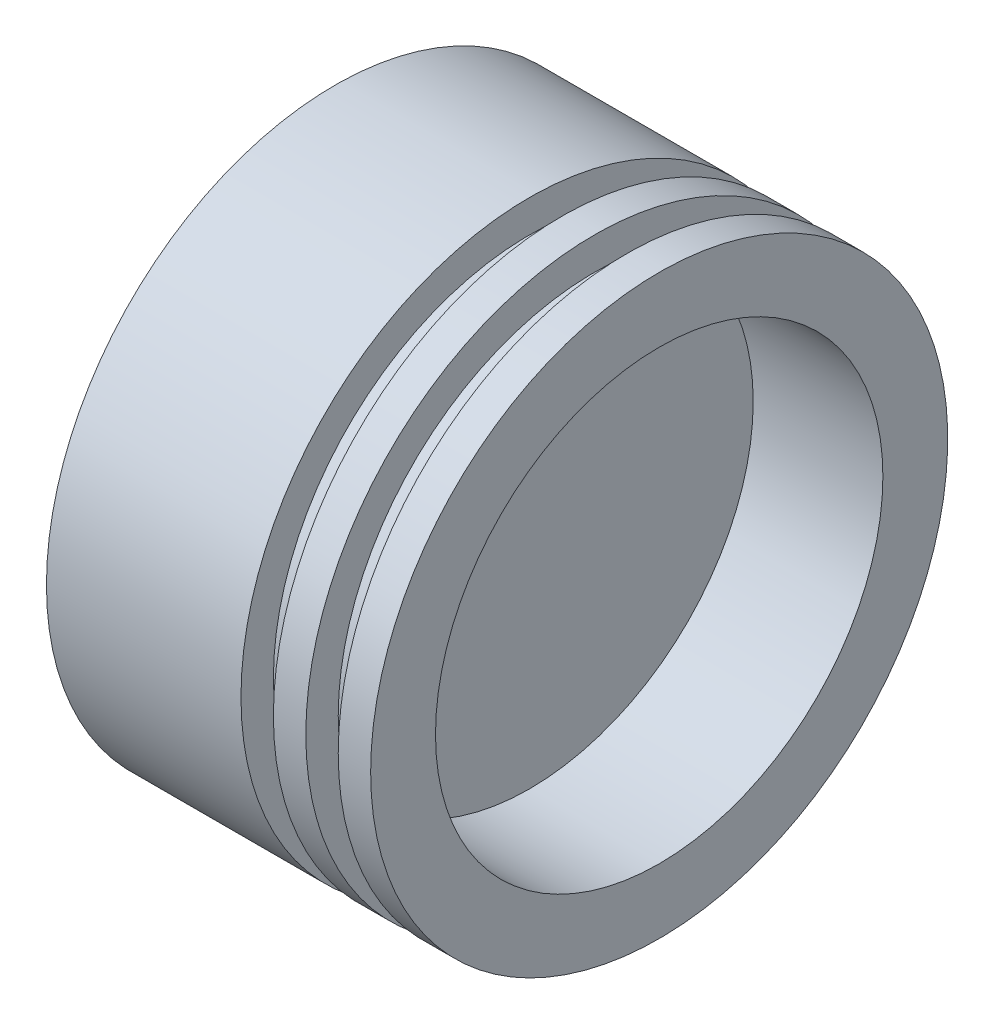
ISO-10303-21;
HEADER;
FILE_DESCRIPTION(('STEP AP214'),'2;1');
FILE_NAME('part.step','',(''),(''),'','','');
FILE_SCHEMA(('AUTOMOTIVE_DESIGN { 1 0 10303 214 1 1 1 1 }'));
ENDSEC;
DATA;
#1=APPLICATION_CONTEXT('core data for automotive mechanical design processes');
#2=APPLICATION_PROTOCOL_DEFINITION('international standard','automotive_design',2000,#1);
#3=PRODUCT_CONTEXT('',#1,'mechanical');
#4=PRODUCT('Part','Part','',(#3));
#5=PRODUCT_RELATED_PRODUCT_CATEGORY('part','',(#4));
#6=PRODUCT_DEFINITION_FORMATION('','',#4);
#7=PRODUCT_DEFINITION_CONTEXT('part definition',#1,'design');
#8=PRODUCT_DEFINITION('design','',#6,#7);
#9=PRODUCT_DEFINITION_SHAPE('','',#8);
#10=(LENGTH_UNIT() NAMED_UNIT(*) SI_UNIT(.MILLI.,.METRE.));
#11=(NAMED_UNIT(*) PLANE_ANGLE_UNIT() SI_UNIT($,.RADIAN.));
#12=(NAMED_UNIT(*) SI_UNIT($,.STERADIAN.) SOLID_ANGLE_UNIT());
#13=UNCERTAINTY_MEASURE_WITH_UNIT(LENGTH_MEASURE(1.E-05),#10,'distance_accuracy_value','');
#14=(GEOMETRIC_REPRESENTATION_CONTEXT(3) GLOBAL_UNCERTAINTY_ASSIGNED_CONTEXT((#13)) GLOBAL_UNIT_ASSIGNED_CONTEXT((#10,
#11,#12)) REPRESENTATION_CONTEXT('',''));
#15=CARTESIAN_POINT('',(0.,0.,0.));
#16=DIRECTION('',(0.,0.,1.));
#17=DIRECTION('',(1.,0.,0.));
#18=AXIS2_PLACEMENT_3D('',#15,#16,#17);
#19=CARTESIAN_POINT('',(0.,0.,0.));
#20=DIRECTION('',(1.,0.,0.));
#21=DIRECTION('',(0.,0.,-1.));
#22=AXIS2_PLACEMENT_3D('',#19,#20,#21);
#23=PLANE('',#22);
#24=CARTESIAN_POINT('',(0.,0.,0.));
#25=DIRECTION('',(-1.,0.,0.));
#26=DIRECTION('',(0.,0.,1.));
#27=AXIS2_PLACEMENT_3D('',#24,#25,#26);
#28=CIRCLE('',#27,44.5);
#29=CARTESIAN_POINT('',(0.,0.,44.5));
#30=VERTEX_POINT('',#29);
#31=EDGE_CURVE('E10',#30,#30,#28,.T.);
#32=ORIENTED_EDGE('',*,*,#31,.T.);
#33=EDGE_LOOP('',(#32));
#34=FACE_BOUND('',#33,.T.);
#35=ADVANCED_FACE('F35',(#34),#23,.F.);
#36=CARTESIAN_POINT('',(0.,0.,0.));
#37=DIRECTION('',(-1.,0.,0.));
#38=DIRECTION('',(0.,0.,1.));
#39=AXIS2_PLACEMENT_3D('',#36,#37,#38);
#40=CYLINDRICAL_SURFACE('',#39,44.5);
#41=ORIENTED_EDGE('',*,*,#31,.F.);
#42=EDGE_LOOP('',(#41));
#43=FACE_BOUND('',#42,.T.);
#44=CARTESIAN_POINT('',(30.,0.,0.));
#45=DIRECTION('',(-1.,0.,0.));
#46=DIRECTION('',(0.,0.,1.));
#47=AXIS2_PLACEMENT_3D('',#44,#45,#46);
#48=CIRCLE('',#47,44.5);
#49=CARTESIAN_POINT('',(30.,0.,44.5));
#50=VERTEX_POINT('',#49);
#51=EDGE_CURVE('E41',#50,#50,#48,.T.);
#52=ORIENTED_EDGE('',*,*,#51,.T.);
#53=EDGE_LOOP('',(#52));
#54=FACE_BOUND('',#53,.T.);
#55=ADVANCED_FACE('F91',(#43,#54),#40,.T.);
#56=CARTESIAN_POINT('',(30.,44.5,0.));
#57=DIRECTION('',(-1.,0.,0.));
#58=DIRECTION('',(0.,0.,1.));
#59=AXIS2_PLACEMENT_3D('',#56,#57,#58);
#60=PLANE('',#59);
#61=ORIENTED_EDGE('',*,*,#51,.F.);
#62=EDGE_LOOP('',(#61));
#63=FACE_BOUND('',#62,.T.);
#64=CARTESIAN_POINT('',(30.,0.,0.));
#65=DIRECTION('',(-1.,0.,0.));
#66=DIRECTION('',(0.,0.,1.));
#67=AXIS2_PLACEMENT_3D('',#64,#65,#66);
#68=CIRCLE('',#67,39.5);
#69=CARTESIAN_POINT('',(30.,0.,39.5));
#70=VERTEX_POINT('',#69);
#71=EDGE_CURVE('E45',#70,#70,#68,.T.);
#72=ORIENTED_EDGE('',*,*,#71,.T.);
#73=EDGE_LOOP('',(#72));
#74=FACE_BOUND('',#73,.T.);
#75=ADVANCED_FACE('F95',(#63,#74),#60,.F.);
#76=CARTESIAN_POINT('',(0.,0.,0.));
#77=DIRECTION('',(-1.,0.,0.));
#78=DIRECTION('',(0.,0.,1.));
#79=AXIS2_PLACEMENT_3D('',#76,#77,#78);
#80=CYLINDRICAL_SURFACE('',#79,39.5);
#81=ORIENTED_EDGE('',*,*,#71,.F.);
#82=EDGE_LOOP('',(#81));
#83=FACE_BOUND('',#82,.T.);
#84=CARTESIAN_POINT('',(35.,0.,0.));
#85=DIRECTION('',(-1.,0.,0.));
#86=DIRECTION('',(0.,0.,1.));
#87=AXIS2_PLACEMENT_3D('',#84,#85,#86);
#88=CIRCLE('',#87,39.5);
#89=CARTESIAN_POINT('',(35.,0.,39.5));
#90=VERTEX_POINT('',#89);
#91=EDGE_CURVE('E49',#90,#90,#88,.T.);
#92=ORIENTED_EDGE('',*,*,#91,.T.);
#93=EDGE_LOOP('',(#92));
#94=FACE_BOUND('',#93,.T.);
#95=ADVANCED_FACE('F100',(#83,#94),#80,.T.);
#96=CARTESIAN_POINT('',(35.,39.5,0.));
#97=DIRECTION('',(1.,0.,0.));
#98=DIRECTION('',(0.,0.,-1.));
#99=AXIS2_PLACEMENT_3D('',#96,#97,#98);
#100=PLANE('',#99);
#101=ORIENTED_EDGE('',*,*,#91,.F.);
#102=EDGE_LOOP('',(#101));
#103=FACE_BOUND('',#102,.T.);
#104=CARTESIAN_POINT('',(35.,0.,0.));
#105=DIRECTION('',(-1.,0.,0.));
#106=DIRECTION('',(0.,0.,1.));
#107=AXIS2_PLACEMENT_3D('',#104,#105,#106);
#108=CIRCLE('',#107,44.5);
#109=CARTESIAN_POINT('',(35.,0.,44.5));
#110=VERTEX_POINT('',#109);
#111=EDGE_CURVE('E54',#110,#110,#108,.T.);
#112=ORIENTED_EDGE('',*,*,#111,.T.);
#113=EDGE_LOOP('',(#112));
#114=FACE_BOUND('',#113,.T.);
#115=ADVANCED_FACE('F106',(#103,#114),#100,.F.);
#116=CARTESIAN_POINT('',(0.,0.,0.));
#117=DIRECTION('',(-1.,0.,0.));
#118=DIRECTION('',(0.,0.,1.));
#119=AXIS2_PLACEMENT_3D('',#116,#117,#118);
#120=CYLINDRICAL_SURFACE('',#119,44.5);
#121=ORIENTED_EDGE('',*,*,#111,.F.);
#122=EDGE_LOOP('',(#121));
#123=FACE_BOUND('',#122,.T.);
#124=CARTESIAN_POINT('',(40.,0.,0.));
#125=DIRECTION('',(-1.,0.,0.));
#126=DIRECTION('',(0.,0.,1.));
#127=AXIS2_PLACEMENT_3D('',#124,#125,#126);
#128=CIRCLE('',#127,44.5);
#129=CARTESIAN_POINT('',(40.,0.,44.5));
#130=VERTEX_POINT('',#129);
#131=EDGE_CURVE('E57',#130,#130,#128,.T.);
#132=ORIENTED_EDGE('',*,*,#131,.T.);
#133=EDGE_LOOP('',(#132));
#134=FACE_BOUND('',#133,.T.);
#135=ADVANCED_FACE('F110',(#123,#134),#120,.T.);
#136=CARTESIAN_POINT('',(40.,44.5,0.));
#137=DIRECTION('',(-1.,0.,0.));
#138=DIRECTION('',(0.,0.,1.));
#139=AXIS2_PLACEMENT_3D('',#136,#137,#138);
#140=PLANE('',#139);
#141=ORIENTED_EDGE('',*,*,#131,.F.);
#142=EDGE_LOOP('',(#141));
#143=FACE_BOUND('',#142,.T.);
#144=CARTESIAN_POINT('',(40.,0.,0.));
#145=DIRECTION('',(-1.,0.,0.));
#146=DIRECTION('',(0.,0.,1.));
#147=AXIS2_PLACEMENT_3D('',#144,#145,#146);
#148=CIRCLE('',#147,39.5);
#149=CARTESIAN_POINT('',(40.,0.,39.5));
#150=VERTEX_POINT('',#149);
#151=EDGE_CURVE('E60',#150,#150,#148,.T.);
#152=ORIENTED_EDGE('',*,*,#151,.T.);
#153=EDGE_LOOP('',(#152));
#154=FACE_BOUND('',#153,.T.);
#155=ADVANCED_FACE('F114',(#143,#154),#140,.F.);
#156=CARTESIAN_POINT('',(0.,0.,0.));
#157=DIRECTION('',(-1.,0.,0.));
#158=DIRECTION('',(0.,0.,1.));
#159=AXIS2_PLACEMENT_3D('',#156,#157,#158);
#160=CYLINDRICAL_SURFACE('',#159,39.5);
#161=ORIENTED_EDGE('',*,*,#151,.F.);
#162=EDGE_LOOP('',(#161));
#163=FACE_BOUND('',#162,.T.);
#164=CARTESIAN_POINT('',(45.,0.,0.));
#165=DIRECTION('',(-1.,0.,0.));
#166=DIRECTION('',(0.,0.,1.));
#167=AXIS2_PLACEMENT_3D('',#164,#165,#166);
#168=CIRCLE('',#167,39.5);
#169=CARTESIAN_POINT('',(45.,0.,39.5));
#170=VERTEX_POINT('',#169);
#171=EDGE_CURVE('E63',#170,#170,#168,.T.);
#172=ORIENTED_EDGE('',*,*,#171,.T.);
#173=EDGE_LOOP('',(#172));
#174=FACE_BOUND('',#173,.T.);
#175=ADVANCED_FACE('F118',(#163,#174),#160,.T.);
#176=CARTESIAN_POINT('',(45.,39.5,0.));
#177=DIRECTION('',(1.,0.,0.));
#178=DIRECTION('',(0.,0.,-1.));
#179=AXIS2_PLACEMENT_3D('',#176,#177,#178);
#180=PLANE('',#179);
#181=ORIENTED_EDGE('',*,*,#171,.F.);
#182=EDGE_LOOP('',(#181));
#183=FACE_BOUND('',#182,.T.);
#184=CARTESIAN_POINT('',(45.,0.,0.));
#185=DIRECTION('',(-1.,0.,0.));
#186=DIRECTION('',(0.,0.,1.));
#187=AXIS2_PLACEMENT_3D('',#184,#185,#186);
#188=CIRCLE('',#187,44.5);
#189=CARTESIAN_POINT('',(45.,0.,44.5));
#190=VERTEX_POINT('',#189);
#191=EDGE_CURVE('E66',#190,#190,#188,.T.);
#192=ORIENTED_EDGE('',*,*,#191,.T.);
#193=EDGE_LOOP('',(#192));
#194=FACE_BOUND('',#193,.T.);
#195=ADVANCED_FACE('F122',(#183,#194),#180,.F.);
#196=CARTESIAN_POINT('',(0.,0.,0.));
#197=DIRECTION('',(-1.,0.,0.));
#198=DIRECTION('',(0.,0.,1.));
#199=AXIS2_PLACEMENT_3D('',#196,#197,#198);
#200=CYLINDRICAL_SURFACE('',#199,44.5);
#201=ORIENTED_EDGE('',*,*,#191,.F.);
#202=EDGE_LOOP('',(#201));
#203=FACE_BOUND('',#202,.T.);
#204=CARTESIAN_POINT('',(50.,0.,0.));
#205=DIRECTION('',(-1.,0.,0.));
#206=DIRECTION('',(0.,0.,1.));
#207=AXIS2_PLACEMENT_3D('',#204,#205,#206);
#208=CIRCLE('',#207,44.5);
#209=CARTESIAN_POINT('',(50.,0.,44.5));
#210=VERTEX_POINT('',#209);
#211=EDGE_CURVE('E69',#210,#210,#208,.T.);
#212=ORIENTED_EDGE('',*,*,#211,.T.);
#213=EDGE_LOOP('',(#212));
#214=FACE_BOUND('',#213,.T.);
#215=ADVANCED_FACE('F126',(#203,#214),#200,.T.);
#216=CARTESIAN_POINT('',(50.,44.5,0.));
#217=DIRECTION('',(-1.,0.,0.));
#218=DIRECTION('',(0.,0.,1.));
#219=AXIS2_PLACEMENT_3D('',#216,#217,#218);
#220=PLANE('',#219);
#221=ORIENTED_EDGE('',*,*,#211,.F.);
#222=EDGE_LOOP('',(#221));
#223=FACE_BOUND('',#222,.T.);
#224=CARTESIAN_POINT('',(50.,0.,0.));
#225=DIRECTION('',(-1.,0.,0.));
#226=DIRECTION('',(0.,0.,1.));
#227=AXIS2_PLACEMENT_3D('',#224,#225,#226);
#228=CIRCLE('',#227,34.5);
#229=CARTESIAN_POINT('',(50.,0.,34.5));
#230=VERTEX_POINT('',#229);
#231=EDGE_CURVE('E72',#230,#230,#228,.T.);
#232=ORIENTED_EDGE('',*,*,#231,.T.);
#233=EDGE_LOOP('',(#232));
#234=FACE_BOUND('',#233,.T.);
#235=ADVANCED_FACE('F87',(#223,#234),#220,.F.);
#236=CARTESIAN_POINT('',(0.,0.,0.));
#237=DIRECTION('',(-1.,0.,0.));
#238=DIRECTION('',(0.,0.,1.));
#239=AXIS2_PLACEMENT_3D('',#236,#237,#238);
#240=CYLINDRICAL_SURFACE('',#239,34.5);
#241=ORIENTED_EDGE('',*,*,#231,.F.);
#242=EDGE_LOOP('',(#241));
#243=FACE_BOUND('',#242,.T.);
#244=CARTESIAN_POINT('',(30.,0.,0.));
#245=DIRECTION('',(-1.,0.,0.));
#246=DIRECTION('',(0.,0.,1.));
#247=AXIS2_PLACEMENT_3D('',#244,#245,#246);
#248=CIRCLE('',#247,34.5);
#249=CARTESIAN_POINT('',(30.,0.,34.5));
#250=VERTEX_POINT('',#249);
#251=EDGE_CURVE('E75',#250,#250,#248,.T.);
#252=ORIENTED_EDGE('',*,*,#251,.T.);
#253=EDGE_LOOP('',(#252));
#254=FACE_BOUND('',#253,.T.);
#255=ADVANCED_FACE('F79',(#243,#254),#240,.F.);
#256=CARTESIAN_POINT('',(30.,34.5,0.));
#257=DIRECTION('',(-1.,0.,0.));
#258=DIRECTION('',(0.,0.,1.));
#259=AXIS2_PLACEMENT_3D('',#256,#257,#258);
#260=PLANE('',#259);
#261=ORIENTED_EDGE('',*,*,#251,.F.);
#262=EDGE_LOOP('',(#261));
#263=FACE_BOUND('',#262,.T.);
#264=ADVANCED_FACE('F81',(#263),#260,.F.);
#265=CLOSED_SHELL('',(#35,#55,#75,#95,#115,#135,#155,#175,#195,#215,#235,#255,#264));
#266=MANIFOLD_SOLID_BREP('B2',#265);
#267=ADVANCED_BREP_SHAPE_REPRESENTATION('',(#18,#266),#14);
#268=SHAPE_DEFINITION_REPRESENTATION(#9,#267);
ENDSEC;
END-ISO-10303-21;
